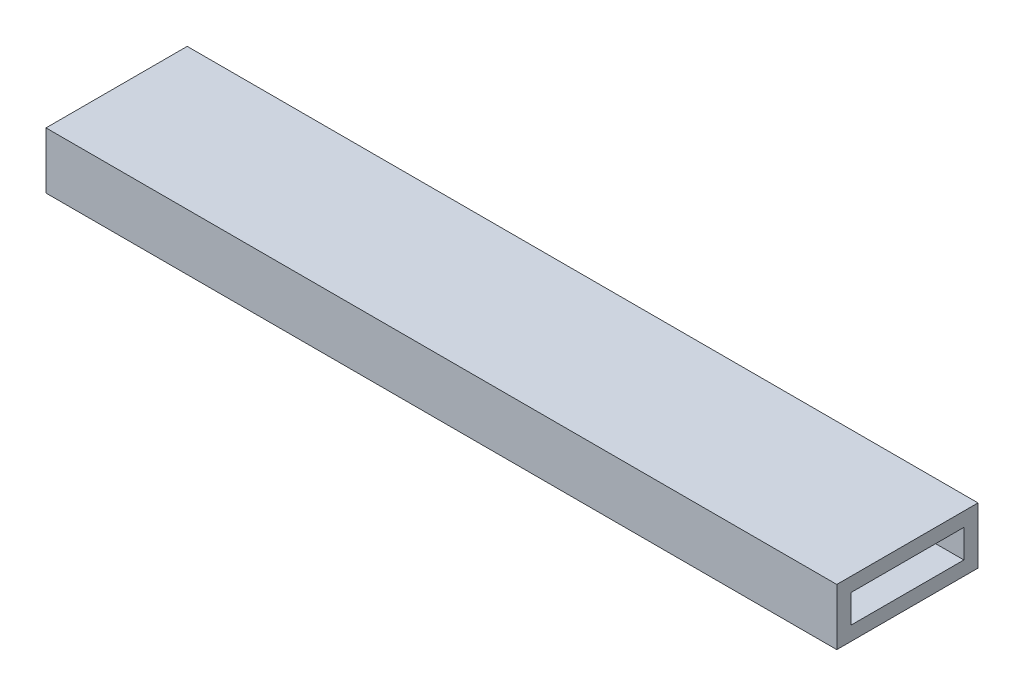
ISO-10303-21;
HEADER;
FILE_DESCRIPTION(('STEP AP214'),'2;1');
FILE_NAME('part.step','',(''),(''),'','','');
FILE_SCHEMA(('AUTOMOTIVE_DESIGN { 1 0 10303 214 1 1 1 1 }'));
ENDSEC;
DATA;
#1=APPLICATION_CONTEXT('core data for automotive mechanical design processes');
#2=APPLICATION_PROTOCOL_DEFINITION('international standard','automotive_design',2000,#1);
#3=PRODUCT_CONTEXT('',#1,'mechanical');
#4=PRODUCT('Part','Part','',(#3));
#5=PRODUCT_RELATED_PRODUCT_CATEGORY('part','',(#4));
#6=PRODUCT_DEFINITION_FORMATION('','',#4);
#7=PRODUCT_DEFINITION_CONTEXT('part definition',#1,'design');
#8=PRODUCT_DEFINITION('design','',#6,#7);
#9=PRODUCT_DEFINITION_SHAPE('','',#8);
#10=(LENGTH_UNIT() NAMED_UNIT(*) SI_UNIT(.MILLI.,.METRE.));
#11=(NAMED_UNIT(*) PLANE_ANGLE_UNIT() SI_UNIT($,.RADIAN.));
#12=(NAMED_UNIT(*) SI_UNIT($,.STERADIAN.) SOLID_ANGLE_UNIT());
#13=UNCERTAINTY_MEASURE_WITH_UNIT(LENGTH_MEASURE(1.E-05),#10,'distance_accuracy_value','');
#14=(GEOMETRIC_REPRESENTATION_CONTEXT(3) GLOBAL_UNCERTAINTY_ASSIGNED_CONTEXT((#13)) GLOBAL_UNIT_ASSIGNED_CONTEXT((#10,
#11,#12)) REPRESENTATION_CONTEXT('',''));
#15=CARTESIAN_POINT('',(0.,0.,0.));
#16=DIRECTION('',(0.,0.,1.));
#17=DIRECTION('',(1.,0.,0.));
#18=AXIS2_PLACEMENT_3D('',#15,#16,#17);
#19=CARTESIAN_POINT('',(560.,0.,0.));
#20=DIRECTION('',(-1.,0.,0.));
#21=DIRECTION('',(0.,0.,1.));
#22=AXIS2_PLACEMENT_3D('',#19,#20,#21);
#23=PLANE('',#22);
#24=DIRECTION('',(0.,-1.,0.));
#25=VECTOR('',#24,1.);
#26=CARTESIAN_POINT('',(560.,0.,0.));
#27=LINE('',#26,#25);
#28=CARTESIAN_POINT('',(560.,40.,0.));
#29=VERTEX_POINT('',#28);
#30=CARTESIAN_POINT('',(560.,0.,0.));
#31=VERTEX_POINT('',#30);
#32=EDGE_CURVE('E133',#29,#31,#27,.T.);
#33=ORIENTED_EDGE('',*,*,#32,.T.);
#34=DIRECTION('',(0.,0.,-1.));
#35=VECTOR('',#34,1.);
#36=CARTESIAN_POINT('',(560.,0.,0.));
#37=LINE('',#36,#35);
#38=CARTESIAN_POINT('',(560.,0.,-100.));
#39=VERTEX_POINT('',#38);
#40=EDGE_CURVE('E136',#31,#39,#37,.T.);
#41=ORIENTED_EDGE('',*,*,#40,.T.);
#42=DIRECTION('',(0.,1.,0.));
#43=VECTOR('',#42,1.);
#44=CARTESIAN_POINT('',(560.,0.,-100.));
#45=LINE('',#44,#43);
#46=CARTESIAN_POINT('',(560.,40.,-100.));
#47=VERTEX_POINT('',#46);
#48=EDGE_CURVE('E139',#39,#47,#45,.T.);
#49=ORIENTED_EDGE('',*,*,#48,.T.);
#50=DIRECTION('',(0.,0.,1.));
#51=VECTOR('',#50,1.);
#52=CARTESIAN_POINT('',(560.,40.,0.));
#53=LINE('',#52,#51);
#54=EDGE_CURVE('E141',#47,#29,#53,.T.);
#55=ORIENTED_EDGE('',*,*,#54,.T.);
#56=EDGE_LOOP('',(#33,#41,#49,#55));
#57=FACE_BOUND('',#56,.T.);
#58=DIRECTION('',(0.,-1.,0.));
#59=VECTOR('',#58,1.);
#60=CARTESIAN_POINT('',(560.,10.,-10.));
#61=LINE('',#60,#59);
#62=CARTESIAN_POINT('',(560.,30.,-10.));
#63=VERTEX_POINT('',#62);
#64=CARTESIAN_POINT('',(560.,10.,-10.));
#65=VERTEX_POINT('',#64);
#66=EDGE_CURVE('E97',#63,#65,#61,.T.);
#67=ORIENTED_EDGE('',*,*,#66,.F.);
#68=DIRECTION('',(0.,0.,1.));
#69=VECTOR('',#68,1.);
#70=CARTESIAN_POINT('',(560.,30.,-10.));
#71=LINE('',#70,#69);
#72=CARTESIAN_POINT('',(560.,30.,-90.));
#73=VERTEX_POINT('',#72);
#74=EDGE_CURVE('E119',#73,#63,#71,.T.);
#75=ORIENTED_EDGE('',*,*,#74,.F.);
#76=DIRECTION('',(0.,1.,0.));
#77=VECTOR('',#76,1.);
#78=CARTESIAN_POINT('',(560.,10.,-90.));
#79=LINE('',#78,#77);
#80=CARTESIAN_POINT('',(560.,10.,-90.));
#81=VERTEX_POINT('',#80);
#82=EDGE_CURVE('E117',#81,#73,#79,.T.);
#83=ORIENTED_EDGE('',*,*,#82,.F.);
#84=DIRECTION('',(0.,0.,-1.));
#85=VECTOR('',#84,1.);
#86=CARTESIAN_POINT('',(560.,10.,-10.));
#87=LINE('',#86,#85);
#88=EDGE_CURVE('E105',#65,#81,#87,.T.);
#89=ORIENTED_EDGE('',*,*,#88,.F.);
#90=EDGE_LOOP('',(#67,#75,#83,#89));
#91=FACE_BOUND('',#90,.T.);
#92=ADVANCED_FACE('F32',(#57,#91),#23,.F.);
#93=CARTESIAN_POINT('',(0.,0.,0.));
#94=DIRECTION('',(-1.,0.,0.));
#95=DIRECTION('',(0.,0.,1.));
#96=AXIS2_PLACEMENT_3D('',#93,#94,#95);
#97=PLANE('',#96);
#98=DIRECTION('',(0.,-1.,0.));
#99=VECTOR('',#98,1.);
#100=CARTESIAN_POINT('',(0.,0.,0.));
#101=LINE('',#100,#99);
#102=CARTESIAN_POINT('',(0.,40.,0.));
#103=VERTEX_POINT('',#102);
#104=CARTESIAN_POINT('',(0.,0.,0.));
#105=VERTEX_POINT('',#104);
#106=EDGE_CURVE('E113',#103,#105,#101,.T.);
#107=ORIENTED_EDGE('',*,*,#106,.F.);
#108=DIRECTION('',(0.,0.,1.));
#109=VECTOR('',#108,1.);
#110=CARTESIAN_POINT('',(0.,40.,0.));
#111=LINE('',#110,#109);
#112=CARTESIAN_POINT('',(0.,40.,-100.));
#113=VERTEX_POINT('',#112);
#114=EDGE_CURVE('E137',#113,#103,#111,.T.);
#115=ORIENTED_EDGE('',*,*,#114,.F.);
#116=DIRECTION('',(0.,1.,0.));
#117=VECTOR('',#116,1.);
#118=CARTESIAN_POINT('',(0.,0.,-100.));
#119=LINE('',#118,#117);
#120=CARTESIAN_POINT('',(0.,0.,-100.));
#121=VERTEX_POINT('',#120);
#122=EDGE_CURVE('E148',#121,#113,#119,.T.);
#123=ORIENTED_EDGE('',*,*,#122,.F.);
#124=DIRECTION('',(0.,0.,-1.));
#125=VECTOR('',#124,1.);
#126=CARTESIAN_POINT('',(0.,0.,0.));
#127=LINE('',#126,#125);
#128=EDGE_CURVE('E146',#105,#121,#127,.T.);
#129=ORIENTED_EDGE('',*,*,#128,.F.);
#130=EDGE_LOOP('',(#107,#115,#123,#129));
#131=FACE_BOUND('',#130,.T.);
#132=DIRECTION('',(0.,0.,1.));
#133=VECTOR('',#132,1.);
#134=CARTESIAN_POINT('',(0.,30.,-10.));
#135=LINE('',#134,#133);
#136=CARTESIAN_POINT('',(0.,30.,-90.));
#137=VERTEX_POINT('',#136);
#138=CARTESIAN_POINT('',(0.,30.,-10.));
#139=VERTEX_POINT('',#138);
#140=EDGE_CURVE('E106',#137,#139,#135,.T.);
#141=ORIENTED_EDGE('',*,*,#140,.T.);
#142=DIRECTION('',(0.,-1.,0.));
#143=VECTOR('',#142,1.);
#144=CARTESIAN_POINT('',(0.,10.,-10.));
#145=LINE('',#144,#143);
#146=CARTESIAN_POINT('',(0.,10.,-10.));
#147=VERTEX_POINT('',#146);
#148=EDGE_CURVE('E55',#139,#147,#145,.T.);
#149=ORIENTED_EDGE('',*,*,#148,.T.);
#150=DIRECTION('',(0.,0.,-1.));
#151=VECTOR('',#150,1.);
#152=CARTESIAN_POINT('',(0.,10.,-10.));
#153=LINE('',#152,#151);
#154=CARTESIAN_POINT('',(0.,10.,-90.));
#155=VERTEX_POINT('',#154);
#156=EDGE_CURVE('E112',#147,#155,#153,.T.);
#157=ORIENTED_EDGE('',*,*,#156,.T.);
#158=DIRECTION('',(0.,1.,0.));
#159=VECTOR('',#158,1.);
#160=CARTESIAN_POINT('',(0.,10.,-90.));
#161=LINE('',#160,#159);
#162=EDGE_CURVE('E125',#155,#137,#161,.T.);
#163=ORIENTED_EDGE('',*,*,#162,.T.);
#164=EDGE_LOOP('',(#141,#149,#157,#163));
#165=FACE_BOUND('',#164,.T.);
#166=ADVANCED_FACE('F166',(#131,#165),#97,.T.);
#167=CARTESIAN_POINT('',(560.,0.,0.));
#168=DIRECTION('',(0.,0.,-1.));
#169=DIRECTION('',(-1.,0.,0.));
#170=AXIS2_PLACEMENT_3D('',#167,#168,#169);
#171=PLANE('',#170);
#172=ORIENTED_EDGE('',*,*,#106,.T.);
#173=DIRECTION('',(-1.,0.,0.));
#174=VECTOR('',#173,1.);
#175=CARTESIAN_POINT('',(560.,0.,0.));
#176=LINE('',#175,#174);
#177=EDGE_CURVE('E11',#31,#105,#176,.T.);
#178=ORIENTED_EDGE('',*,*,#177,.F.);
#179=ORIENTED_EDGE('',*,*,#32,.F.);
#180=DIRECTION('',(-1.,0.,0.));
#181=VECTOR('',#180,1.);
#182=CARTESIAN_POINT('',(560.,40.,0.));
#183=LINE('',#182,#181);
#184=EDGE_CURVE('E143',#29,#103,#183,.T.);
#185=ORIENTED_EDGE('',*,*,#184,.T.);
#186=EDGE_LOOP('',(#172,#178,#179,#185));
#187=FACE_BOUND('',#186,.T.);
#188=ADVANCED_FACE('F34',(#187),#171,.F.);
#189=CARTESIAN_POINT('',(560.,0.,0.));
#190=DIRECTION('',(0.,1.,0.));
#191=DIRECTION('',(0.,0.,1.));
#192=AXIS2_PLACEMENT_3D('',#189,#190,#191);
#193=PLANE('',#192);
#194=ORIENTED_EDGE('',*,*,#128,.T.);
#195=DIRECTION('',(-1.,0.,0.));
#196=VECTOR('',#195,1.);
#197=CARTESIAN_POINT('',(560.,0.,-100.));
#198=LINE('',#197,#196);
#199=EDGE_CURVE('E40',#39,#121,#198,.T.);
#200=ORIENTED_EDGE('',*,*,#199,.F.);
#201=ORIENTED_EDGE('',*,*,#40,.F.);
#202=ORIENTED_EDGE('',*,*,#177,.T.);
#203=EDGE_LOOP('',(#194,#200,#201,#202));
#204=FACE_BOUND('',#203,.T.);
#205=ADVANCED_FACE('F176',(#204),#193,.F.);
#206=CARTESIAN_POINT('',(560.,0.,-100.));
#207=DIRECTION('',(0.,0.,1.));
#208=DIRECTION('',(1.,0.,0.));
#209=AXIS2_PLACEMENT_3D('',#206,#207,#208);
#210=PLANE('',#209);
#211=ORIENTED_EDGE('',*,*,#122,.T.);
#212=DIRECTION('',(-1.,0.,0.));
#213=VECTOR('',#212,1.);
#214=CARTESIAN_POINT('',(560.,40.,-100.));
#215=LINE('',#214,#213);
#216=EDGE_CURVE('E153',#47,#113,#215,.T.);
#217=ORIENTED_EDGE('',*,*,#216,.F.);
#218=ORIENTED_EDGE('',*,*,#48,.F.);
#219=ORIENTED_EDGE('',*,*,#199,.T.);
#220=EDGE_LOOP('',(#211,#217,#218,#219));
#221=FACE_BOUND('',#220,.T.);
#222=ADVANCED_FACE('F160',(#221),#210,.F.);
#223=CARTESIAN_POINT('',(560.,40.,0.));
#224=DIRECTION('',(0.,-1.,0.));
#225=DIRECTION('',(0.,0.,-1.));
#226=AXIS2_PLACEMENT_3D('',#223,#224,#225);
#227=PLANE('',#226);
#228=ORIENTED_EDGE('',*,*,#114,.T.);
#229=ORIENTED_EDGE('',*,*,#184,.F.);
#230=ORIENTED_EDGE('',*,*,#54,.F.);
#231=ORIENTED_EDGE('',*,*,#216,.T.);
#232=EDGE_LOOP('',(#228,#229,#230,#231));
#233=FACE_BOUND('',#232,.T.);
#234=ADVANCED_FACE('F170',(#233),#227,.F.);
#235=CARTESIAN_POINT('',(560.,10.,-10.));
#236=DIRECTION('',(0.,0.,-1.));
#237=DIRECTION('',(-1.,0.,0.));
#238=AXIS2_PLACEMENT_3D('',#235,#236,#237);
#239=PLANE('',#238);
#240=ORIENTED_EDGE('',*,*,#148,.F.);
#241=DIRECTION('',(-1.,0.,0.));
#242=VECTOR('',#241,1.);
#243=CARTESIAN_POINT('',(560.,30.,-10.));
#244=LINE('',#243,#242);
#245=EDGE_CURVE('E101',#63,#139,#244,.T.);
#246=ORIENTED_EDGE('',*,*,#245,.F.);
#247=ORIENTED_EDGE('',*,*,#66,.T.);
#248=DIRECTION('',(-1.,0.,0.));
#249=VECTOR('',#248,1.);
#250=CARTESIAN_POINT('',(560.,10.,-10.));
#251=LINE('',#250,#249);
#252=EDGE_CURVE('E100',#65,#147,#251,.T.);
#253=ORIENTED_EDGE('',*,*,#252,.T.);
#254=EDGE_LOOP('',(#240,#246,#247,#253));
#255=FACE_BOUND('',#254,.T.);
#256=ADVANCED_FACE('F99',(#255),#239,.T.);
#257=CARTESIAN_POINT('',(560.,10.,-10.));
#258=DIRECTION('',(0.,1.,0.));
#259=DIRECTION('',(0.,0.,1.));
#260=AXIS2_PLACEMENT_3D('',#257,#258,#259);
#261=PLANE('',#260);
#262=ORIENTED_EDGE('',*,*,#156,.F.);
#263=ORIENTED_EDGE('',*,*,#252,.F.);
#264=ORIENTED_EDGE('',*,*,#88,.T.);
#265=DIRECTION('',(-1.,0.,0.));
#266=VECTOR('',#265,1.);
#267=CARTESIAN_POINT('',(560.,10.,-90.));
#268=LINE('',#267,#266);
#269=EDGE_CURVE('E114',#81,#155,#268,.T.);
#270=ORIENTED_EDGE('',*,*,#269,.T.);
#271=EDGE_LOOP('',(#262,#263,#264,#270));
#272=FACE_BOUND('',#271,.T.);
#273=ADVANCED_FACE('F109',(#272),#261,.T.);
#274=CARTESIAN_POINT('',(560.,10.,-90.));
#275=DIRECTION('',(0.,0.,1.));
#276=DIRECTION('',(1.,0.,0.));
#277=AXIS2_PLACEMENT_3D('',#274,#275,#276);
#278=PLANE('',#277);
#279=ORIENTED_EDGE('',*,*,#162,.F.);
#280=ORIENTED_EDGE('',*,*,#269,.F.);
#281=ORIENTED_EDGE('',*,*,#82,.T.);
#282=DIRECTION('',(-1.,0.,0.));
#283=VECTOR('',#282,1.);
#284=CARTESIAN_POINT('',(560.,30.,-90.));
#285=LINE('',#284,#283);
#286=EDGE_CURVE('E47',#73,#137,#285,.T.);
#287=ORIENTED_EDGE('',*,*,#286,.T.);
#288=EDGE_LOOP('',(#279,#280,#281,#287));
#289=FACE_BOUND('',#288,.T.);
#290=ADVANCED_FACE('F199',(#289),#278,.T.);
#291=CARTESIAN_POINT('',(560.,30.,-10.));
#292=DIRECTION('',(0.,-1.,0.));
#293=DIRECTION('',(0.,0.,-1.));
#294=AXIS2_PLACEMENT_3D('',#291,#292,#293);
#295=PLANE('',#294);
#296=ORIENTED_EDGE('',*,*,#140,.F.);
#297=ORIENTED_EDGE('',*,*,#286,.F.);
#298=ORIENTED_EDGE('',*,*,#74,.T.);
#299=ORIENTED_EDGE('',*,*,#245,.T.);
#300=EDGE_LOOP('',(#296,#297,#298,#299));
#301=FACE_BOUND('',#300,.T.);
#302=ADVANCED_FACE('F203',(#301),#295,.T.);
#303=CLOSED_SHELL('',(#92,#166,#188,#205,#222,#234,#256,#273,#290,#302));
#304=MANIFOLD_SOLID_BREP('B2',#303);
#305=ADVANCED_BREP_SHAPE_REPRESENTATION('',(#18,#304),#14);
#306=SHAPE_DEFINITION_REPRESENTATION(#9,#305);
ENDSEC;
END-ISO-10303-21;
